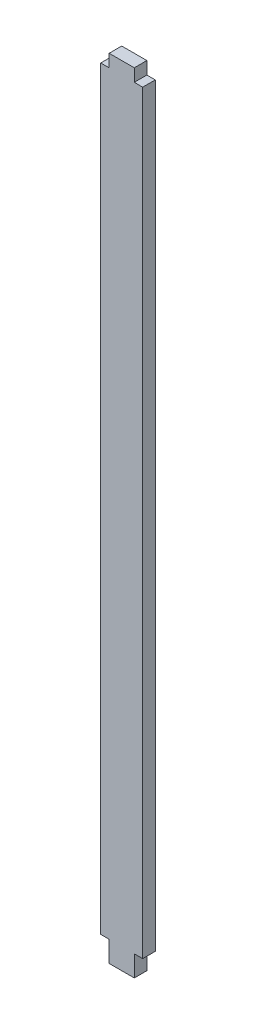
ISO-10303-21;
HEADER;
FILE_DESCRIPTION(('STEP AP214'),'2;1');
FILE_NAME('part.step','',(''),(''),'','','');
FILE_SCHEMA(('AUTOMOTIVE_DESIGN { 1 0 10303 214 1 1 1 1 }'));
ENDSEC;
DATA;
#1=APPLICATION_CONTEXT('core data for automotive mechanical design processes');
#2=APPLICATION_PROTOCOL_DEFINITION('international standard','automotive_design',2000,#1);
#3=PRODUCT_CONTEXT('',#1,'mechanical');
#4=PRODUCT('Part','Part','',(#3));
#5=PRODUCT_RELATED_PRODUCT_CATEGORY('part','',(#4));
#6=PRODUCT_DEFINITION_FORMATION('','',#4);
#7=PRODUCT_DEFINITION_CONTEXT('part definition',#1,'design');
#8=PRODUCT_DEFINITION('design','',#6,#7);
#9=PRODUCT_DEFINITION_SHAPE('','',#8);
#10=(LENGTH_UNIT() NAMED_UNIT(*) SI_UNIT(.MILLI.,.METRE.));
#11=(NAMED_UNIT(*) PLANE_ANGLE_UNIT() SI_UNIT($,.RADIAN.));
#12=(NAMED_UNIT(*) SI_UNIT($,.STERADIAN.) SOLID_ANGLE_UNIT());
#13=UNCERTAINTY_MEASURE_WITH_UNIT(LENGTH_MEASURE(1.E-05),#10,'distance_accuracy_value','');
#14=(GEOMETRIC_REPRESENTATION_CONTEXT(3) GLOBAL_UNCERTAINTY_ASSIGNED_CONTEXT((#13)) GLOBAL_UNIT_ASSIGNED_CONTEXT((#10,
#11,#12)) REPRESENTATION_CONTEXT('',''));
#15=CARTESIAN_POINT('',(0.,0.,0.));
#16=DIRECTION('',(0.,0.,1.));
#17=DIRECTION('',(1.,0.,0.));
#18=AXIS2_PLACEMENT_3D('',#15,#16,#17);
#19=CARTESIAN_POINT('',(-5.,-90.0000000000001,3.));
#20=DIRECTION('',(1.,0.,0.));
#21=DIRECTION('',(0.,0.,-1.));
#22=AXIS2_PLACEMENT_3D('',#19,#20,#21);
#23=PLANE('',#22);
#24=DIRECTION('',(0.,-1.,0.));
#25=VECTOR('',#24,1.);
#26=CARTESIAN_POINT('',(-5.,-90.0000000000001,0.));
#27=LINE('',#26,#25);
#28=CARTESIAN_POINT('',(-5.,89.9999999999999,0.));
#29=VERTEX_POINT('',#28);
#30=CARTESIAN_POINT('',(-5.,-90.0000000000001,0.));
#31=VERTEX_POINT('',#30);
#32=EDGE_CURVE('E153',#29,#31,#27,.T.);
#33=ORIENTED_EDGE('',*,*,#32,.T.);
#34=DIRECTION('',(0.,0.,-1.));
#35=VECTOR('',#34,1.);
#36=CARTESIAN_POINT('',(-5.,-90.0000000000001,3.));
#37=LINE('',#36,#35);
#38=CARTESIAN_POINT('',(-5.,-90.0000000000001,3.));
#39=VERTEX_POINT('',#38);
#40=EDGE_CURVE('E11',#39,#31,#37,.T.);
#41=ORIENTED_EDGE('',*,*,#40,.F.);
#42=DIRECTION('',(0.,-1.,0.));
#43=VECTOR('',#42,1.);
#44=CARTESIAN_POINT('',(-5.,-90.0000000000001,3.));
#45=LINE('',#44,#43);
#46=CARTESIAN_POINT('',(-5.,89.9999999999999,3.));
#47=VERTEX_POINT('',#46);
#48=EDGE_CURVE('E175',#47,#39,#45,.T.);
#49=ORIENTED_EDGE('',*,*,#48,.F.);
#50=DIRECTION('',(0.,0.,-1.));
#51=VECTOR('',#50,1.);
#52=CARTESIAN_POINT('',(-5.,89.9999999999999,3.));
#53=LINE('',#52,#51);
#54=EDGE_CURVE('E149',#47,#29,#53,.T.);
#55=ORIENTED_EDGE('',*,*,#54,.T.);
#56=EDGE_LOOP('',(#33,#41,#49,#55));
#57=FACE_BOUND('',#56,.T.);
#58=ADVANCED_FACE('F33',(#57),#23,.F.);
#59=CARTESIAN_POINT('',(-3.,-90.0000000000001,3.));
#60=DIRECTION('',(0.,1.,0.));
#61=DIRECTION('',(0.,0.,1.));
#62=AXIS2_PLACEMENT_3D('',#59,#60,#61);
#63=PLANE('',#62);
#64=DIRECTION('',(1.,0.,0.));
#65=VECTOR('',#64,1.);
#66=CARTESIAN_POINT('',(-3.,-90.0000000000001,0.));
#67=LINE('',#66,#65);
#68=CARTESIAN_POINT('',(-3.,-90.0000000000001,0.));
#69=VERTEX_POINT('',#68);
#70=EDGE_CURVE('E156',#31,#69,#67,.T.);
#71=ORIENTED_EDGE('',*,*,#70,.T.);
#72=DIRECTION('',(0.,0.,-1.));
#73=VECTOR('',#72,1.);
#74=CARTESIAN_POINT('',(-3.,-90.0000000000001,3.));
#75=LINE('',#74,#73);
#76=CARTESIAN_POINT('',(-3.,-90.0000000000001,3.));
#77=VERTEX_POINT('',#76);
#78=EDGE_CURVE('E41',#77,#69,#75,.T.);
#79=ORIENTED_EDGE('',*,*,#78,.F.);
#80=DIRECTION('',(1.,0.,0.));
#81=VECTOR('',#80,1.);
#82=CARTESIAN_POINT('',(-3.,-90.0000000000001,3.));
#83=LINE('',#82,#81);
#84=EDGE_CURVE('E104',#39,#77,#83,.T.);
#85=ORIENTED_EDGE('',*,*,#84,.F.);
#86=ORIENTED_EDGE('',*,*,#40,.T.);
#87=EDGE_LOOP('',(#71,#79,#85,#86));
#88=FACE_BOUND('',#87,.T.);
#89=ADVANCED_FACE('F253',(#88),#63,.F.);
#90=CARTESIAN_POINT('',(-3.,-90.0000000000001,3.));
#91=DIRECTION('',(1.,0.,0.));
#92=DIRECTION('',(0.,0.,-1.));
#93=AXIS2_PLACEMENT_3D('',#90,#91,#92);
#94=PLANE('',#93);
#95=DIRECTION('',(0.,-1.,0.));
#96=VECTOR('',#95,1.);
#97=CARTESIAN_POINT('',(-3.,-90.0000000000001,0.));
#98=LINE('',#97,#96);
#99=CARTESIAN_POINT('',(-3.,-95.0000000000001,0.));
#100=VERTEX_POINT('',#99);
#101=EDGE_CURVE('E158',#69,#100,#98,.T.);
#102=ORIENTED_EDGE('',*,*,#101,.T.);
#103=DIRECTION('',(0.,0.,-1.));
#104=VECTOR('',#103,1.);
#105=CARTESIAN_POINT('',(-3.,-95.0000000000001,3.));
#106=LINE('',#105,#104);
#107=CARTESIAN_POINT('',(-3.,-95.0000000000001,3.));
#108=VERTEX_POINT('',#107);
#109=EDGE_CURVE('E194',#108,#100,#106,.T.);
#110=ORIENTED_EDGE('',*,*,#109,.F.);
#111=DIRECTION('',(0.,-1.,0.));
#112=VECTOR('',#111,1.);
#113=CARTESIAN_POINT('',(-3.,-90.0000000000001,3.));
#114=LINE('',#113,#112);
#115=EDGE_CURVE('E202',#77,#108,#114,.T.);
#116=ORIENTED_EDGE('',*,*,#115,.F.);
#117=ORIENTED_EDGE('',*,*,#78,.T.);
#118=EDGE_LOOP('',(#102,#110,#116,#117));
#119=FACE_BOUND('',#118,.T.);
#120=ADVANCED_FACE('F200',(#119),#94,.F.);
#121=CARTESIAN_POINT('',(-3.,-95.0000000000001,3.));
#122=DIRECTION('',(0.,1.,0.));
#123=DIRECTION('',(0.,0.,1.));
#124=AXIS2_PLACEMENT_3D('',#121,#122,#123);
#125=PLANE('',#124);
#126=DIRECTION('',(1.,0.,0.));
#127=VECTOR('',#126,1.);
#128=CARTESIAN_POINT('',(-3.,-95.0000000000001,0.));
#129=LINE('',#128,#127);
#130=CARTESIAN_POINT('',(3.,-95.0000000000001,0.));
#131=VERTEX_POINT('',#130);
#132=EDGE_CURVE('E160',#100,#131,#129,.T.);
#133=ORIENTED_EDGE('',*,*,#132,.T.);
#134=DIRECTION('',(0.,0.,-1.));
#135=VECTOR('',#134,1.);
#136=CARTESIAN_POINT('',(3.,-95.0000000000001,3.));
#137=LINE('',#136,#135);
#138=CARTESIAN_POINT('',(3.,-95.0000000000001,3.));
#139=VERTEX_POINT('',#138);
#140=EDGE_CURVE('E191',#139,#131,#137,.T.);
#141=ORIENTED_EDGE('',*,*,#140,.F.);
#142=DIRECTION('',(1.,0.,0.));
#143=VECTOR('',#142,1.);
#144=CARTESIAN_POINT('',(-3.,-95.0000000000001,3.));
#145=LINE('',#144,#143);
#146=EDGE_CURVE('E220',#108,#139,#145,.T.);
#147=ORIENTED_EDGE('',*,*,#146,.F.);
#148=ORIENTED_EDGE('',*,*,#109,.T.);
#149=EDGE_LOOP('',(#133,#141,#147,#148));
#150=FACE_BOUND('',#149,.T.);
#151=ADVANCED_FACE('F211',(#150),#125,.F.);
#152=CARTESIAN_POINT('',(3.,-90.0000000000001,3.));
#153=DIRECTION('',(-1.,0.,0.));
#154=DIRECTION('',(0.,0.,1.));
#155=AXIS2_PLACEMENT_3D('',#152,#153,#154);
#156=PLANE('',#155);
#157=DIRECTION('',(0.,1.,0.));
#158=VECTOR('',#157,1.);
#159=CARTESIAN_POINT('',(3.,-90.0000000000001,0.));
#160=LINE('',#159,#158);
#161=CARTESIAN_POINT('',(3.,-90.0000000000001,0.));
#162=VERTEX_POINT('',#161);
#163=EDGE_CURVE('E162',#131,#162,#160,.T.);
#164=ORIENTED_EDGE('',*,*,#163,.T.);
#165=DIRECTION('',(0.,0.,-1.));
#166=VECTOR('',#165,1.);
#167=CARTESIAN_POINT('',(3.,-90.0000000000001,3.));
#168=LINE('',#167,#166);
#169=CARTESIAN_POINT('',(3.,-90.0000000000001,3.));
#170=VERTEX_POINT('',#169);
#171=EDGE_CURVE('E188',#170,#162,#168,.T.);
#172=ORIENTED_EDGE('',*,*,#171,.F.);
#173=DIRECTION('',(0.,1.,0.));
#174=VECTOR('',#173,1.);
#175=CARTESIAN_POINT('',(3.,-90.0000000000001,3.));
#176=LINE('',#175,#174);
#177=EDGE_CURVE('E217',#139,#170,#176,.T.);
#178=ORIENTED_EDGE('',*,*,#177,.F.);
#179=ORIENTED_EDGE('',*,*,#140,.T.);
#180=EDGE_LOOP('',(#164,#172,#178,#179));
#181=FACE_BOUND('',#180,.T.);
#182=ADVANCED_FACE('F215',(#181),#156,.F.);
#183=CARTESIAN_POINT('',(5.,-90.0000000000001,3.));
#184=DIRECTION('',(0.,1.,0.));
#185=DIRECTION('',(0.,0.,1.));
#186=AXIS2_PLACEMENT_3D('',#183,#184,#185);
#187=PLANE('',#186);
#188=DIRECTION('',(1.,0.,0.));
#189=VECTOR('',#188,1.);
#190=CARTESIAN_POINT('',(5.,-90.0000000000001,0.));
#191=LINE('',#190,#189);
#192=CARTESIAN_POINT('',(5.,-90.0000000000001,0.));
#193=VERTEX_POINT('',#192);
#194=EDGE_CURVE('E164',#162,#193,#191,.T.);
#195=ORIENTED_EDGE('',*,*,#194,.T.);
#196=DIRECTION('',(0.,0.,-1.));
#197=VECTOR('',#196,1.);
#198=CARTESIAN_POINT('',(5.,-90.0000000000001,3.));
#199=LINE('',#198,#197);
#200=CARTESIAN_POINT('',(5.,-90.0000000000001,3.));
#201=VERTEX_POINT('',#200);
#202=EDGE_CURVE('E185',#201,#193,#199,.T.);
#203=ORIENTED_EDGE('',*,*,#202,.F.);
#204=DIRECTION('',(1.,0.,0.));
#205=VECTOR('',#204,1.);
#206=CARTESIAN_POINT('',(5.,-90.0000000000001,3.));
#207=LINE('',#206,#205);
#208=EDGE_CURVE('E219',#170,#201,#207,.T.);
#209=ORIENTED_EDGE('',*,*,#208,.F.);
#210=ORIENTED_EDGE('',*,*,#171,.T.);
#211=EDGE_LOOP('',(#195,#203,#209,#210));
#212=FACE_BOUND('',#211,.T.);
#213=ADVANCED_FACE('F266',(#212),#187,.F.);
#214=CARTESIAN_POINT('',(5.,-90.0000000000001,3.));
#215=DIRECTION('',(-1.,0.,0.));
#216=DIRECTION('',(0.,0.,1.));
#217=AXIS2_PLACEMENT_3D('',#214,#215,#216);
#218=PLANE('',#217);
#219=DIRECTION('',(0.,1.,0.));
#220=VECTOR('',#219,1.);
#221=CARTESIAN_POINT('',(5.,-90.0000000000001,0.));
#222=LINE('',#221,#220);
#223=CARTESIAN_POINT('',(5.,89.9999999999999,0.));
#224=VERTEX_POINT('',#223);
#225=EDGE_CURVE('E166',#193,#224,#222,.T.);
#226=ORIENTED_EDGE('',*,*,#225,.T.);
#227=DIRECTION('',(0.,0.,-1.));
#228=VECTOR('',#227,1.);
#229=CARTESIAN_POINT('',(5.,89.9999999999999,3.));
#230=LINE('',#229,#228);
#231=CARTESIAN_POINT('',(5.,89.9999999999999,3.));
#232=VERTEX_POINT('',#231);
#233=EDGE_CURVE('E182',#232,#224,#230,.T.);
#234=ORIENTED_EDGE('',*,*,#233,.F.);
#235=DIRECTION('',(0.,1.,0.));
#236=VECTOR('',#235,1.);
#237=CARTESIAN_POINT('',(5.,-90.0000000000001,3.));
#238=LINE('',#237,#236);
#239=EDGE_CURVE('E222',#201,#232,#238,.T.);
#240=ORIENTED_EDGE('',*,*,#239,.F.);
#241=ORIENTED_EDGE('',*,*,#202,.T.);
#242=EDGE_LOOP('',(#226,#234,#240,#241));
#243=FACE_BOUND('',#242,.T.);
#244=ADVANCED_FACE('F269',(#243),#218,.F.);
#245=CARTESIAN_POINT('',(5.,89.9999999999999,3.));
#246=DIRECTION('',(0.,-1.,0.));
#247=DIRECTION('',(0.,0.,-1.));
#248=AXIS2_PLACEMENT_3D('',#245,#246,#247);
#249=PLANE('',#248);
#250=DIRECTION('',(-1.,0.,0.));
#251=VECTOR('',#250,1.);
#252=CARTESIAN_POINT('',(5.,89.9999999999999,0.));
#253=LINE('',#252,#251);
#254=CARTESIAN_POINT('',(3.,89.9999999999999,0.));
#255=VERTEX_POINT('',#254);
#256=EDGE_CURVE('E168',#224,#255,#253,.T.);
#257=ORIENTED_EDGE('',*,*,#256,.T.);
#258=DIRECTION('',(0.,0.,-1.));
#259=VECTOR('',#258,1.);
#260=CARTESIAN_POINT('',(3.,89.9999999999999,3.));
#261=LINE('',#260,#259);
#262=CARTESIAN_POINT('',(3.,89.9999999999999,3.));
#263=VERTEX_POINT('',#262);
#264=EDGE_CURVE('E179',#263,#255,#261,.T.);
#265=ORIENTED_EDGE('',*,*,#264,.F.);
#266=DIRECTION('',(-1.,0.,0.));
#267=VECTOR('',#266,1.);
#268=CARTESIAN_POINT('',(5.,89.9999999999999,3.));
#269=LINE('',#268,#267);
#270=EDGE_CURVE('E228',#232,#263,#269,.T.);
#271=ORIENTED_EDGE('',*,*,#270,.F.);
#272=ORIENTED_EDGE('',*,*,#233,.T.);
#273=EDGE_LOOP('',(#257,#265,#271,#272));
#274=FACE_BOUND('',#273,.T.);
#275=ADVANCED_FACE('F234',(#274),#249,.F.);
#276=CARTESIAN_POINT('',(3.,89.9999999999999,3.));
#277=DIRECTION('',(-1.,0.,0.));
#278=DIRECTION('',(0.,0.,1.));
#279=AXIS2_PLACEMENT_3D('',#276,#277,#278);
#280=PLANE('',#279);
#281=DIRECTION('',(0.,1.,0.));
#282=VECTOR('',#281,1.);
#283=CARTESIAN_POINT('',(3.,89.9999999999999,0.));
#284=LINE('',#283,#282);
#285=CARTESIAN_POINT('',(3.,92.9999999999999,0.));
#286=VERTEX_POINT('',#285);
#287=EDGE_CURVE('E170',#255,#286,#284,.T.);
#288=ORIENTED_EDGE('',*,*,#287,.T.);
#289=DIRECTION('',(0.,0.,-1.));
#290=VECTOR('',#289,1.);
#291=CARTESIAN_POINT('',(3.,92.9999999999999,3.));
#292=LINE('',#291,#290);
#293=CARTESIAN_POINT('',(3.,92.9999999999999,3.));
#294=VERTEX_POINT('',#293);
#295=EDGE_CURVE('E144',#294,#286,#292,.T.);
#296=ORIENTED_EDGE('',*,*,#295,.F.);
#297=DIRECTION('',(0.,1.,0.));
#298=VECTOR('',#297,1.);
#299=CARTESIAN_POINT('',(3.,89.9999999999999,3.));
#300=LINE('',#299,#298);
#301=EDGE_CURVE('E135',#263,#294,#300,.T.);
#302=ORIENTED_EDGE('',*,*,#301,.F.);
#303=ORIENTED_EDGE('',*,*,#264,.T.);
#304=EDGE_LOOP('',(#288,#296,#302,#303));
#305=FACE_BOUND('',#304,.T.);
#306=ADVANCED_FACE('F238',(#305),#280,.F.);
#307=CARTESIAN_POINT('',(3.,92.9999999999999,3.));
#308=DIRECTION('',(0.,-1.,0.));
#309=DIRECTION('',(0.,0.,-1.));
#310=AXIS2_PLACEMENT_3D('',#307,#308,#309);
#311=PLANE('',#310);
#312=DIRECTION('',(-1.,0.,0.));
#313=VECTOR('',#312,1.);
#314=CARTESIAN_POINT('',(3.,92.9999999999999,0.));
#315=LINE('',#314,#313);
#316=CARTESIAN_POINT('',(-3.,92.9999999999999,0.));
#317=VERTEX_POINT('',#316);
#318=EDGE_CURVE('E143',#286,#317,#315,.T.);
#319=ORIENTED_EDGE('',*,*,#318,.T.);
#320=DIRECTION('',(0.,0.,-1.));
#321=VECTOR('',#320,1.);
#322=CARTESIAN_POINT('',(-3.,92.9999999999999,3.));
#323=LINE('',#322,#321);
#324=CARTESIAN_POINT('',(-3.,92.9999999999999,3.));
#325=VERTEX_POINT('',#324);
#326=EDGE_CURVE('E140',#325,#317,#323,.T.);
#327=ORIENTED_EDGE('',*,*,#326,.F.);
#328=DIRECTION('',(-1.,0.,0.));
#329=VECTOR('',#328,1.);
#330=CARTESIAN_POINT('',(3.,92.9999999999999,3.));
#331=LINE('',#330,#329);
#332=EDGE_CURVE('E129',#294,#325,#331,.T.);
#333=ORIENTED_EDGE('',*,*,#332,.F.);
#334=ORIENTED_EDGE('',*,*,#295,.T.);
#335=EDGE_LOOP('',(#319,#327,#333,#334));
#336=FACE_BOUND('',#335,.T.);
#337=ADVANCED_FACE('F141',(#336),#311,.F.);
#338=CARTESIAN_POINT('',(-3.,89.9999999999999,3.));
#339=DIRECTION('',(1.,0.,0.));
#340=DIRECTION('',(0.,0.,-1.));
#341=AXIS2_PLACEMENT_3D('',#338,#339,#340);
#342=PLANE('',#341);
#343=DIRECTION('',(0.,-1.,0.));
#344=VECTOR('',#343,1.);
#345=CARTESIAN_POINT('',(-3.,89.9999999999999,0.));
#346=LINE('',#345,#344);
#347=CARTESIAN_POINT('',(-3.,89.9999999999999,0.));
#348=VERTEX_POINT('',#347);
#349=EDGE_CURVE('E90',#317,#348,#346,.T.);
#350=ORIENTED_EDGE('',*,*,#349,.T.);
#351=DIRECTION('',(0.,0.,-1.));
#352=VECTOR('',#351,1.);
#353=CARTESIAN_POINT('',(-3.,89.9999999999999,3.));
#354=LINE('',#353,#352);
#355=CARTESIAN_POINT('',(-3.,89.9999999999999,3.));
#356=VERTEX_POINT('',#355);
#357=EDGE_CURVE('E145',#356,#348,#354,.T.);
#358=ORIENTED_EDGE('',*,*,#357,.F.);
#359=DIRECTION('',(0.,-1.,0.));
#360=VECTOR('',#359,1.);
#361=CARTESIAN_POINT('',(-3.,89.9999999999999,3.));
#362=LINE('',#361,#360);
#363=EDGE_CURVE('E133',#325,#356,#362,.T.);
#364=ORIENTED_EDGE('',*,*,#363,.F.);
#365=ORIENTED_EDGE('',*,*,#326,.T.);
#366=EDGE_LOOP('',(#350,#358,#364,#365));
#367=FACE_BOUND('',#366,.T.);
#368=ADVANCED_FACE('F147',(#367),#342,.F.);
#369=CARTESIAN_POINT('',(-3.,89.9999999999999,3.));
#370=DIRECTION('',(0.,-1.,0.));
#371=DIRECTION('',(0.,0.,-1.));
#372=AXIS2_PLACEMENT_3D('',#369,#370,#371);
#373=PLANE('',#372);
#374=DIRECTION('',(-1.,0.,0.));
#375=VECTOR('',#374,1.);
#376=CARTESIAN_POINT('',(-3.,89.9999999999999,0.));
#377=LINE('',#376,#375);
#378=EDGE_CURVE('E96',#348,#29,#377,.T.);
#379=ORIENTED_EDGE('',*,*,#378,.T.);
#380=ORIENTED_EDGE('',*,*,#54,.F.);
#381=DIRECTION('',(-1.,0.,0.));
#382=VECTOR('',#381,1.);
#383=CARTESIAN_POINT('',(-3.,89.9999999999999,3.));
#384=LINE('',#383,#382);
#385=EDGE_CURVE('E49',#356,#47,#384,.T.);
#386=ORIENTED_EDGE('',*,*,#385,.F.);
#387=ORIENTED_EDGE('',*,*,#357,.T.);
#388=EDGE_LOOP('',(#379,#380,#386,#387));
#389=FACE_BOUND('',#388,.T.);
#390=ADVANCED_FACE('F242',(#389),#373,.F.);
#391=CARTESIAN_POINT('',(0.,0.,3.));
#392=DIRECTION('',(0.,0.,1.));
#393=DIRECTION('',(1.,0.,0.));
#394=AXIS2_PLACEMENT_3D('',#391,#392,#393);
#395=PLANE('',#394);
#396=ORIENTED_EDGE('',*,*,#48,.T.);
#397=ORIENTED_EDGE('',*,*,#84,.T.);
#398=ORIENTED_EDGE('',*,*,#115,.T.);
#399=ORIENTED_EDGE('',*,*,#146,.T.);
#400=ORIENTED_EDGE('',*,*,#177,.T.);
#401=ORIENTED_EDGE('',*,*,#208,.T.);
#402=ORIENTED_EDGE('',*,*,#239,.T.);
#403=ORIENTED_EDGE('',*,*,#270,.T.);
#404=ORIENTED_EDGE('',*,*,#301,.T.);
#405=ORIENTED_EDGE('',*,*,#332,.T.);
#406=ORIENTED_EDGE('',*,*,#363,.T.);
#407=ORIENTED_EDGE('',*,*,#385,.T.);
#408=EDGE_LOOP('',(#396,#397,#398,#399,#400,#401,#402,#403,#404,#405,#406,#407));
#409=FACE_BOUND('',#408,.T.);
#410=ADVANCED_FACE('F131',(#409),#395,.T.);
#411=CARTESIAN_POINT('',(0.,0.,0.));
#412=DIRECTION('',(0.,0.,1.));
#413=DIRECTION('',(1.,0.,0.));
#414=AXIS2_PLACEMENT_3D('',#411,#412,#413);
#415=PLANE('',#414);
#416=ORIENTED_EDGE('',*,*,#32,.F.);
#417=ORIENTED_EDGE('',*,*,#378,.F.);
#418=ORIENTED_EDGE('',*,*,#349,.F.);
#419=ORIENTED_EDGE('',*,*,#318,.F.);
#420=ORIENTED_EDGE('',*,*,#287,.F.);
#421=ORIENTED_EDGE('',*,*,#256,.F.);
#422=ORIENTED_EDGE('',*,*,#225,.F.);
#423=ORIENTED_EDGE('',*,*,#194,.F.);
#424=ORIENTED_EDGE('',*,*,#163,.F.);
#425=ORIENTED_EDGE('',*,*,#132,.F.);
#426=ORIENTED_EDGE('',*,*,#101,.F.);
#427=ORIENTED_EDGE('',*,*,#70,.F.);
#428=EDGE_LOOP('',(#416,#417,#418,#419,#420,#421,#422,#423,#424,#425,#426,#427));
#429=FACE_BOUND('',#428,.T.);
#430=ADVANCED_FACE('F206',(#429),#415,.F.);
#431=CLOSED_SHELL('',(#58,#89,#120,#151,#182,#213,#244,#275,#306,#337,#368,#390,#410,#430));
#432=MANIFOLD_SOLID_BREP('B2',#431);
#433=ADVANCED_BREP_SHAPE_REPRESENTATION('',(#18,#432),#14);
#434=SHAPE_DEFINITION_REPRESENTATION(#9,#433);
ENDSEC;
END-ISO-10303-21;
